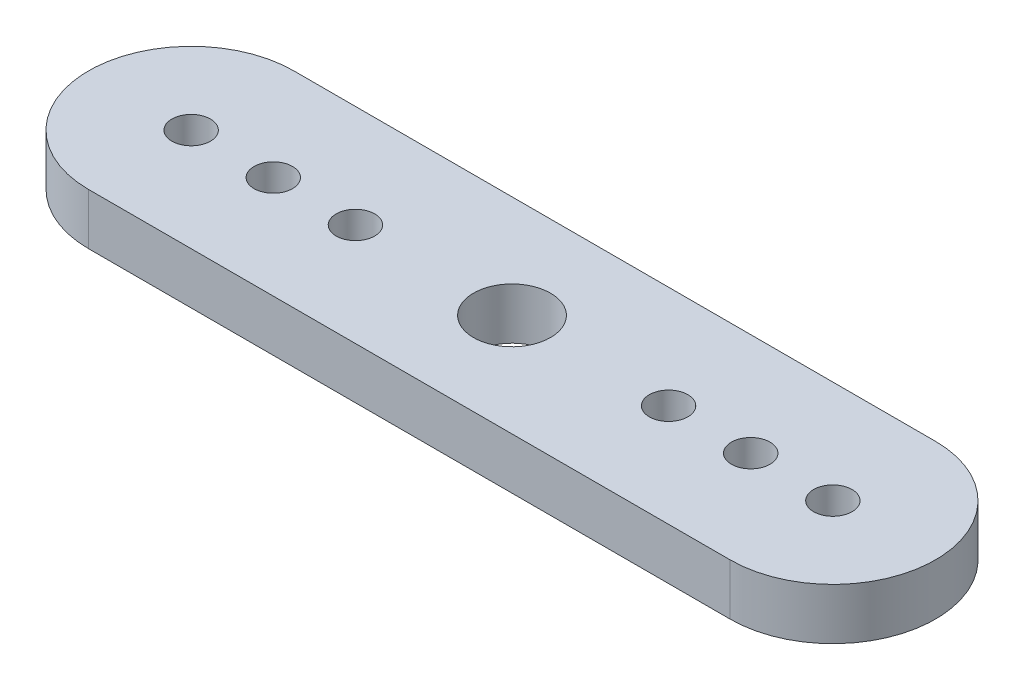
ISO-10303-21;
HEADER;
FILE_DESCRIPTION(('STEP AP214'),'2;1');
FILE_NAME('part.step','',(''),(''),'','','');
FILE_SCHEMA(('AUTOMOTIVE_DESIGN { 1 0 10303 214 1 1 1 1 }'));
ENDSEC;
DATA;
#1=APPLICATION_CONTEXT('core data for automotive mechanical design processes');
#2=APPLICATION_PROTOCOL_DEFINITION('international standard','automotive_design',2000,#1);
#3=PRODUCT_CONTEXT('',#1,'mechanical');
#4=PRODUCT('Part','Part','',(#3));
#5=PRODUCT_RELATED_PRODUCT_CATEGORY('part','',(#4));
#6=PRODUCT_DEFINITION_FORMATION('','',#4);
#7=PRODUCT_DEFINITION_CONTEXT('part definition',#1,'design');
#8=PRODUCT_DEFINITION('design','',#6,#7);
#9=PRODUCT_DEFINITION_SHAPE('','',#8);
#10=(LENGTH_UNIT() NAMED_UNIT(*) SI_UNIT(.MILLI.,.METRE.));
#11=(NAMED_UNIT(*) PLANE_ANGLE_UNIT() SI_UNIT($,.RADIAN.));
#12=(NAMED_UNIT(*) SI_UNIT($,.STERADIAN.) SOLID_ANGLE_UNIT());
#13=UNCERTAINTY_MEASURE_WITH_UNIT(LENGTH_MEASURE(1.E-05),#10,'distance_accuracy_value','');
#14=(GEOMETRIC_REPRESENTATION_CONTEXT(3) GLOBAL_UNCERTAINTY_ASSIGNED_CONTEXT((#13)) GLOBAL_UNIT_ASSIGNED_CONTEXT((#10,
#11,#12)) REPRESENTATION_CONTEXT('',''));
#15=CARTESIAN_POINT('',(0.,0.,0.));
#16=DIRECTION('',(0.,0.,1.));
#17=DIRECTION('',(1.,0.,0.));
#18=AXIS2_PLACEMENT_3D('',#15,#16,#17);
#19=CARTESIAN_POINT('',(0.,-26.,264.));
#20=DIRECTION('',(0.,-1.,0.));
#21=DIRECTION('',(1.,0.,0.));
#22=AXIS2_PLACEMENT_3D('',#19,#20,#21);
#23=PLANE('',#22);
#24=CARTESIAN_POINT('',(-21.8,-26.,264.));
#25=DIRECTION('',(0.,-1.,0.));
#26=DIRECTION('',(-1.,0.,0.));
#27=AXIS2_PLACEMENT_3D('',#24,#25,#26);
#28=CIRCLE('',#27,0.749999999999999);
#29=CARTESIAN_POINT('',(-22.55,-26.,264.));
#30=VERTEX_POINT('',#29);
#31=EDGE_CURVE('E147',#30,#30,#28,.T.);
#32=ORIENTED_EDGE('',*,*,#31,.F.);
#33=EDGE_LOOP('',(#32));
#34=FACE_BOUND('',#33,.T.);
#35=CARTESIAN_POINT('',(-3.2,-26.,264.));
#36=DIRECTION('',(0.,-1.,0.));
#37=DIRECTION('',(1.,0.,0.));
#38=AXIS2_PLACEMENT_3D('',#35,#36,#37);
#39=CIRCLE('',#38,0.750000000000001);
#40=CARTESIAN_POINT('',(-2.45,-26.,264.));
#41=VERTEX_POINT('',#40);
#42=EDGE_CURVE('E135',#41,#41,#39,.T.);
#43=ORIENTED_EDGE('',*,*,#42,.F.);
#44=EDGE_LOOP('',(#43));
#45=FACE_BOUND('',#44,.T.);
#46=CARTESIAN_POINT('',(0.,-26.,264.));
#47=DIRECTION('',(0.,-1.,0.));
#48=DIRECTION('',(1.,0.,0.));
#49=AXIS2_PLACEMENT_3D('',#46,#47,#48);
#50=CIRCLE('',#49,0.750000000000001);
#51=CARTESIAN_POINT('',(0.750000000000004,-26.,264.));
#52=VERTEX_POINT('',#51);
#53=EDGE_CURVE('E123',#52,#52,#50,.T.);
#54=ORIENTED_EDGE('',*,*,#53,.F.);
#55=EDGE_LOOP('',(#54));
#56=FACE_BOUND('',#55,.T.);
#57=CARTESIAN_POINT('',(0.,-26.,264.));
#58=DIRECTION('',(0.,-1.,0.));
#59=DIRECTION('',(1.,0.,0.));
#60=AXIS2_PLACEMENT_3D('',#57,#58,#59);
#61=CIRCLE('',#60,4.);
#62=CARTESIAN_POINT('',(0.,-26.,260.));
#63=VERTEX_POINT('',#62);
#64=CARTESIAN_POINT('',(0.,-26.,268.));
#65=VERTEX_POINT('',#64);
#66=EDGE_CURVE('E93',#63,#65,#61,.T.);
#67=ORIENTED_EDGE('',*,*,#66,.T.);
#68=DIRECTION('',(-1.,0.,0.));
#69=VECTOR('',#68,1.);
#70=CARTESIAN_POINT('',(0.,-26.,268.));
#71=LINE('',#70,#69);
#72=CARTESIAN_POINT('',(-25.,-26.,268.));
#73=VERTEX_POINT('',#72);
#74=EDGE_CURVE('E88',#65,#73,#71,.T.);
#75=ORIENTED_EDGE('',*,*,#74,.T.);
#76=CARTESIAN_POINT('',(-25.,-26.,264.));
#77=DIRECTION('',(0.,-1.,0.));
#78=DIRECTION('',(1.,0.,0.));
#79=AXIS2_PLACEMENT_3D('',#76,#77,#78);
#80=CIRCLE('',#79,4.);
#81=CARTESIAN_POINT('',(-25.,-26.,260.));
#82=VERTEX_POINT('',#81);
#83=EDGE_CURVE('E91',#73,#82,#80,.T.);
#84=ORIENTED_EDGE('',*,*,#83,.T.);
#85=DIRECTION('',(1.,0.,0.));
#86=VECTOR('',#85,1.);
#87=CARTESIAN_POINT('',(0.,-26.,260.));
#88=LINE('',#87,#86);
#89=EDGE_CURVE('E58',#82,#63,#88,.T.);
#90=ORIENTED_EDGE('',*,*,#89,.T.);
#91=EDGE_LOOP('',(#67,#75,#84,#90));
#92=FACE_BOUND('',#91,.T.);
#93=CARTESIAN_POINT('',(-12.5,-26.,264.));
#94=DIRECTION('',(0.,-1.,0.));
#95=DIRECTION('',(1.,0.,0.));
#96=AXIS2_PLACEMENT_3D('',#93,#94,#95);
#97=CIRCLE('',#96,1.5);
#98=CARTESIAN_POINT('',(-11.,-26.,264.));
#99=VERTEX_POINT('',#98);
#100=EDGE_CURVE('E108',#99,#99,#97,.T.);
#101=ORIENTED_EDGE('',*,*,#100,.F.);
#102=EDGE_LOOP('',(#101));
#103=FACE_BOUND('',#102,.T.);
#104=CARTESIAN_POINT('',(-6.4,-26.,264.));
#105=DIRECTION('',(0.,-1.,0.));
#106=DIRECTION('',(1.,0.,0.));
#107=AXIS2_PLACEMENT_3D('',#104,#105,#106);
#108=CIRCLE('',#107,0.750000000000001);
#109=CARTESIAN_POINT('',(-5.65,-26.,264.));
#110=VERTEX_POINT('',#109);
#111=EDGE_CURVE('E129',#110,#110,#108,.T.);
#112=ORIENTED_EDGE('',*,*,#111,.F.);
#113=EDGE_LOOP('',(#112));
#114=FACE_BOUND('',#113,.T.);
#115=CARTESIAN_POINT('',(-25.,-26.,264.));
#116=DIRECTION('',(0.,-1.,0.));
#117=DIRECTION('',(-1.,0.,0.));
#118=AXIS2_PLACEMENT_3D('',#115,#116,#117);
#119=CIRCLE('',#118,0.750000000000002);
#120=CARTESIAN_POINT('',(-25.75,-26.,264.));
#121=VERTEX_POINT('',#120);
#122=EDGE_CURVE('E141',#121,#121,#119,.T.);
#123=ORIENTED_EDGE('',*,*,#122,.F.);
#124=EDGE_LOOP('',(#123));
#125=FACE_BOUND('',#124,.T.);
#126=CARTESIAN_POINT('',(-18.6,-26.,264.));
#127=DIRECTION('',(0.,-1.,0.));
#128=DIRECTION('',(-1.,0.,0.));
#129=AXIS2_PLACEMENT_3D('',#126,#127,#128);
#130=CIRCLE('',#129,0.749999999999999);
#131=CARTESIAN_POINT('',(-19.35,-26.,264.));
#132=VERTEX_POINT('',#131);
#133=EDGE_CURVE('E153',#132,#132,#130,.T.);
#134=ORIENTED_EDGE('',*,*,#133,.F.);
#135=EDGE_LOOP('',(#134));
#136=FACE_BOUND('',#135,.T.);
#137=ADVANCED_FACE('F41',(#34,#45,#56,#92,#103,#114,#125,#136),#23,.T.);
#138=CARTESIAN_POINT('',(0.,-24.,264.));
#139=DIRECTION('',(0.,-1.,0.));
#140=DIRECTION('',(1.,0.,0.));
#141=AXIS2_PLACEMENT_3D('',#138,#139,#140);
#142=PLANE('',#141);
#143=CARTESIAN_POINT('',(0.,-24.,264.));
#144=DIRECTION('',(0.,-1.,0.));
#145=DIRECTION('',(1.,0.,0.));
#146=AXIS2_PLACEMENT_3D('',#143,#144,#145);
#147=CIRCLE('',#146,4.);
#148=CARTESIAN_POINT('',(0.,-24.,260.));
#149=VERTEX_POINT('',#148);
#150=CARTESIAN_POINT('',(0.,-24.,268.));
#151=VERTEX_POINT('',#150);
#152=EDGE_CURVE('E105',#149,#151,#147,.T.);
#153=ORIENTED_EDGE('',*,*,#152,.F.);
#154=DIRECTION('',(1.,0.,0.));
#155=VECTOR('',#154,1.);
#156=CARTESIAN_POINT('',(0.,-24.,260.));
#157=LINE('',#156,#155);
#158=CARTESIAN_POINT('',(-25.,-24.,260.));
#159=VERTEX_POINT('',#158);
#160=EDGE_CURVE('E81',#159,#149,#157,.T.);
#161=ORIENTED_EDGE('',*,*,#160,.F.);
#162=CARTESIAN_POINT('',(-25.,-24.,264.));
#163=DIRECTION('',(0.,-1.,0.));
#164=DIRECTION('',(1.,0.,0.));
#165=AXIS2_PLACEMENT_3D('',#162,#163,#164);
#166=CIRCLE('',#165,4.);
#167=CARTESIAN_POINT('',(-25.,-24.,268.));
#168=VERTEX_POINT('',#167);
#169=EDGE_CURVE('E75',#168,#159,#166,.T.);
#170=ORIENTED_EDGE('',*,*,#169,.F.);
#171=DIRECTION('',(-1.,0.,0.));
#172=VECTOR('',#171,1.);
#173=CARTESIAN_POINT('',(0.,-24.,268.));
#174=LINE('',#173,#172);
#175=EDGE_CURVE('E97',#151,#168,#174,.T.);
#176=ORIENTED_EDGE('',*,*,#175,.F.);
#177=EDGE_LOOP('',(#153,#161,#170,#176));
#178=FACE_BOUND('',#177,.T.);
#179=CARTESIAN_POINT('',(-12.5,-24.,264.));
#180=DIRECTION('',(0.,-1.,0.));
#181=DIRECTION('',(1.,0.,0.));
#182=AXIS2_PLACEMENT_3D('',#179,#180,#181);
#183=CIRCLE('',#182,1.5);
#184=CARTESIAN_POINT('',(-11.,-24.,264.));
#185=VERTEX_POINT('',#184);
#186=EDGE_CURVE('E120',#185,#185,#183,.T.);
#187=ORIENTED_EDGE('',*,*,#186,.T.);
#188=EDGE_LOOP('',(#187));
#189=FACE_BOUND('',#188,.T.);
#190=CARTESIAN_POINT('',(0.,-24.,264.));
#191=DIRECTION('',(0.,-1.,0.));
#192=DIRECTION('',(1.,0.,0.));
#193=AXIS2_PLACEMENT_3D('',#190,#191,#192);
#194=CIRCLE('',#193,0.750000000000001);
#195=CARTESIAN_POINT('',(0.750000000000004,-24.,264.));
#196=VERTEX_POINT('',#195);
#197=EDGE_CURVE('E126',#196,#196,#194,.T.);
#198=ORIENTED_EDGE('',*,*,#197,.T.);
#199=EDGE_LOOP('',(#198));
#200=FACE_BOUND('',#199,.T.);
#201=CARTESIAN_POINT('',(-6.4,-24.,264.));
#202=DIRECTION('',(0.,-1.,0.));
#203=DIRECTION('',(1.,0.,0.));
#204=AXIS2_PLACEMENT_3D('',#201,#202,#203);
#205=CIRCLE('',#204,0.750000000000001);
#206=CARTESIAN_POINT('',(-5.65,-24.,264.));
#207=VERTEX_POINT('',#206);
#208=EDGE_CURVE('E132',#207,#207,#205,.T.);
#209=ORIENTED_EDGE('',*,*,#208,.T.);
#210=EDGE_LOOP('',(#209));
#211=FACE_BOUND('',#210,.T.);
#212=CARTESIAN_POINT('',(-3.2,-24.,264.));
#213=DIRECTION('',(0.,-1.,0.));
#214=DIRECTION('',(1.,0.,0.));
#215=AXIS2_PLACEMENT_3D('',#212,#213,#214);
#216=CIRCLE('',#215,0.750000000000001);
#217=CARTESIAN_POINT('',(-2.45,-24.,264.));
#218=VERTEX_POINT('',#217);
#219=EDGE_CURVE('E138',#218,#218,#216,.T.);
#220=ORIENTED_EDGE('',*,*,#219,.T.);
#221=EDGE_LOOP('',(#220));
#222=FACE_BOUND('',#221,.T.);
#223=CARTESIAN_POINT('',(-25.,-24.,264.));
#224=DIRECTION('',(0.,-1.,0.));
#225=DIRECTION('',(-1.,0.,0.));
#226=AXIS2_PLACEMENT_3D('',#223,#224,#225);
#227=CIRCLE('',#226,0.750000000000002);
#228=CARTESIAN_POINT('',(-25.75,-24.,264.));
#229=VERTEX_POINT('',#228);
#230=EDGE_CURVE('E144',#229,#229,#227,.T.);
#231=ORIENTED_EDGE('',*,*,#230,.T.);
#232=EDGE_LOOP('',(#231));
#233=FACE_BOUND('',#232,.T.);
#234=CARTESIAN_POINT('',(-21.8,-24.,264.));
#235=DIRECTION('',(0.,-1.,0.));
#236=DIRECTION('',(-1.,0.,0.));
#237=AXIS2_PLACEMENT_3D('',#234,#235,#236);
#238=CIRCLE('',#237,0.749999999999999);
#239=CARTESIAN_POINT('',(-22.55,-24.,264.));
#240=VERTEX_POINT('',#239);
#241=EDGE_CURVE('E150',#240,#240,#238,.T.);
#242=ORIENTED_EDGE('',*,*,#241,.T.);
#243=EDGE_LOOP('',(#242));
#244=FACE_BOUND('',#243,.T.);
#245=CARTESIAN_POINT('',(-18.6,-24.,264.));
#246=DIRECTION('',(0.,-1.,0.));
#247=DIRECTION('',(-1.,0.,0.));
#248=AXIS2_PLACEMENT_3D('',#245,#246,#247);
#249=CIRCLE('',#248,0.749999999999999);
#250=CARTESIAN_POINT('',(-19.35,-24.,264.));
#251=VERTEX_POINT('',#250);
#252=EDGE_CURVE('E156',#251,#251,#249,.T.);
#253=ORIENTED_EDGE('',*,*,#252,.T.);
#254=EDGE_LOOP('',(#253));
#255=FACE_BOUND('',#254,.T.);
#256=ADVANCED_FACE('F116',(#178,#189,#200,#211,#222,#233,#244,#255),#142,.F.);
#257=CARTESIAN_POINT('',(0.,-26.,264.));
#258=DIRECTION('',(0.,1.,0.));
#259=DIRECTION('',(-1.,0.,0.));
#260=AXIS2_PLACEMENT_3D('',#257,#258,#259);
#261=CYLINDRICAL_SURFACE('',#260,4.);
#262=ORIENTED_EDGE('',*,*,#152,.T.);
#263=DIRECTION('',(0.,1.,0.));
#264=VECTOR('',#263,1.);
#265=CARTESIAN_POINT('',(0.,-26.,268.));
#266=LINE('',#265,#264);
#267=EDGE_CURVE('E11',#65,#151,#266,.T.);
#268=ORIENTED_EDGE('',*,*,#267,.F.);
#269=ORIENTED_EDGE('',*,*,#66,.F.);
#270=DIRECTION('',(0.,1.,0.));
#271=VECTOR('',#270,1.);
#272=CARTESIAN_POINT('',(0.,-26.,260.));
#273=LINE('',#272,#271);
#274=EDGE_CURVE('E101',#63,#149,#273,.T.);
#275=ORIENTED_EDGE('',*,*,#274,.T.);
#276=EDGE_LOOP('',(#262,#268,#269,#275));
#277=FACE_BOUND('',#276,.T.);
#278=ADVANCED_FACE('F43',(#277),#261,.T.);
#279=CARTESIAN_POINT('',(0.,-26.,268.));
#280=DIRECTION('',(0.,0.,-1.));
#281=DIRECTION('',(-1.,0.,0.));
#282=AXIS2_PLACEMENT_3D('',#279,#280,#281);
#283=PLANE('',#282);
#284=ORIENTED_EDGE('',*,*,#175,.T.);
#285=DIRECTION('',(0.,1.,0.));
#286=VECTOR('',#285,1.);
#287=CARTESIAN_POINT('',(-25.,-26.,268.));
#288=LINE('',#287,#286);
#289=EDGE_CURVE('E50',#73,#168,#288,.T.);
#290=ORIENTED_EDGE('',*,*,#289,.F.);
#291=ORIENTED_EDGE('',*,*,#74,.F.);
#292=ORIENTED_EDGE('',*,*,#267,.T.);
#293=EDGE_LOOP('',(#284,#290,#291,#292));
#294=FACE_BOUND('',#293,.T.);
#295=ADVANCED_FACE('F96',(#294),#283,.F.);
#296=CARTESIAN_POINT('',(-25.,-26.,264.));
#297=DIRECTION('',(0.,1.,0.));
#298=DIRECTION('',(-1.,0.,0.));
#299=AXIS2_PLACEMENT_3D('',#296,#297,#298);
#300=CYLINDRICAL_SURFACE('',#299,4.);
#301=ORIENTED_EDGE('',*,*,#169,.T.);
#302=DIRECTION('',(0.,1.,0.));
#303=VECTOR('',#302,1.);
#304=CARTESIAN_POINT('',(-25.,-26.,260.));
#305=LINE('',#304,#303);
#306=EDGE_CURVE('E98',#82,#159,#305,.T.);
#307=ORIENTED_EDGE('',*,*,#306,.F.);
#308=ORIENTED_EDGE('',*,*,#83,.F.);
#309=ORIENTED_EDGE('',*,*,#289,.T.);
#310=EDGE_LOOP('',(#301,#307,#308,#309));
#311=FACE_BOUND('',#310,.T.);
#312=ADVANCED_FACE('F99',(#311),#300,.T.);
#313=CARTESIAN_POINT('',(0.,-26.,260.));
#314=DIRECTION('',(0.,0.,1.));
#315=DIRECTION('',(1.,0.,0.));
#316=AXIS2_PLACEMENT_3D('',#313,#314,#315);
#317=PLANE('',#316);
#318=ORIENTED_EDGE('',*,*,#160,.T.);
#319=ORIENTED_EDGE('',*,*,#274,.F.);
#320=ORIENTED_EDGE('',*,*,#89,.F.);
#321=ORIENTED_EDGE('',*,*,#306,.T.);
#322=EDGE_LOOP('',(#318,#319,#320,#321));
#323=FACE_BOUND('',#322,.T.);
#324=ADVANCED_FACE('F113',(#323),#317,.F.);
#325=CARTESIAN_POINT('',(-12.5,-26.,264.));
#326=DIRECTION('',(0.,1.,0.));
#327=DIRECTION('',(-1.,0.,0.));
#328=AXIS2_PLACEMENT_3D('',#325,#326,#327);
#329=CYLINDRICAL_SURFACE('',#328,1.5);
#330=ORIENTED_EDGE('',*,*,#100,.T.);
#331=EDGE_LOOP('',(#330));
#332=FACE_BOUND('',#331,.T.);
#333=ORIENTED_EDGE('',*,*,#186,.F.);
#334=EDGE_LOOP('',(#333));
#335=FACE_BOUND('',#334,.T.);
#336=ADVANCED_FACE('F176',(#332,#335),#329,.F.);
#337=CARTESIAN_POINT('',(0.,-26.,264.));
#338=DIRECTION('',(0.,1.,0.));
#339=DIRECTION('',(-1.,0.,0.));
#340=AXIS2_PLACEMENT_3D('',#337,#338,#339);
#341=CYLINDRICAL_SURFACE('',#340,0.750000000000001);
#342=ORIENTED_EDGE('',*,*,#53,.T.);
#343=EDGE_LOOP('',(#342));
#344=FACE_BOUND('',#343,.T.);
#345=ORIENTED_EDGE('',*,*,#197,.F.);
#346=EDGE_LOOP('',(#345));
#347=FACE_BOUND('',#346,.T.);
#348=ADVANCED_FACE('F218',(#344,#347),#341,.F.);
#349=CARTESIAN_POINT('',(-6.4,-26.,264.));
#350=DIRECTION('',(0.,1.,0.));
#351=DIRECTION('',(-1.,0.,0.));
#352=AXIS2_PLACEMENT_3D('',#349,#350,#351);
#353=CYLINDRICAL_SURFACE('',#352,0.750000000000001);
#354=ORIENTED_EDGE('',*,*,#111,.T.);
#355=EDGE_LOOP('',(#354));
#356=FACE_BOUND('',#355,.T.);
#357=ORIENTED_EDGE('',*,*,#208,.F.);
#358=EDGE_LOOP('',(#357));
#359=FACE_BOUND('',#358,.T.);
#360=ADVANCED_FACE('F225',(#356,#359),#353,.F.);
#361=CARTESIAN_POINT('',(-3.2,-26.,264.));
#362=DIRECTION('',(0.,1.,0.));
#363=DIRECTION('',(-1.,0.,0.));
#364=AXIS2_PLACEMENT_3D('',#361,#362,#363);
#365=CYLINDRICAL_SURFACE('',#364,0.750000000000001);
#366=ORIENTED_EDGE('',*,*,#42,.T.);
#367=EDGE_LOOP('',(#366));
#368=FACE_BOUND('',#367,.T.);
#369=ORIENTED_EDGE('',*,*,#219,.F.);
#370=EDGE_LOOP('',(#369));
#371=FACE_BOUND('',#370,.T.);
#372=ADVANCED_FACE('F232',(#368,#371),#365,.F.);
#373=CARTESIAN_POINT('',(-25.,-26.,264.));
#374=DIRECTION('',(0.,1.,0.));
#375=DIRECTION('',(-1.,0.,0.));
#376=AXIS2_PLACEMENT_3D('',#373,#374,#375);
#377=CYLINDRICAL_SURFACE('',#376,0.750000000000002);
#378=ORIENTED_EDGE('',*,*,#122,.T.);
#379=EDGE_LOOP('',(#378));
#380=FACE_BOUND('',#379,.T.);
#381=ORIENTED_EDGE('',*,*,#230,.F.);
#382=EDGE_LOOP('',(#381));
#383=FACE_BOUND('',#382,.T.);
#384=ADVANCED_FACE('F240',(#380,#383),#377,.F.);
#385=CARTESIAN_POINT('',(-21.8,-26.,264.));
#386=DIRECTION('',(0.,1.,0.));
#387=DIRECTION('',(-1.,0.,0.));
#388=AXIS2_PLACEMENT_3D('',#385,#386,#387);
#389=CYLINDRICAL_SURFACE('',#388,0.749999999999999);
#390=ORIENTED_EDGE('',*,*,#31,.T.);
#391=EDGE_LOOP('',(#390));
#392=FACE_BOUND('',#391,.T.);
#393=ORIENTED_EDGE('',*,*,#241,.F.);
#394=EDGE_LOOP('',(#393));
#395=FACE_BOUND('',#394,.T.);
#396=ADVANCED_FACE('F248',(#392,#395),#389,.F.);
#397=CARTESIAN_POINT('',(-18.6,-26.,264.));
#398=DIRECTION('',(0.,1.,0.));
#399=DIRECTION('',(-1.,0.,0.));
#400=AXIS2_PLACEMENT_3D('',#397,#398,#399);
#401=CYLINDRICAL_SURFACE('',#400,0.749999999999999);
#402=ORIENTED_EDGE('',*,*,#133,.T.);
#403=EDGE_LOOP('',(#402));
#404=FACE_BOUND('',#403,.T.);
#405=ORIENTED_EDGE('',*,*,#252,.F.);
#406=EDGE_LOOP('',(#405));
#407=FACE_BOUND('',#406,.T.);
#408=ADVANCED_FACE('F162',(#404,#407),#401,.F.);
#409=CLOSED_SHELL('',(#137,#256,#278,#295,#312,#324,#336,#348,#360,#372,#384,#396,#408));
#410=MANIFOLD_SOLID_BREP('B2',#409);
#411=ADVANCED_BREP_SHAPE_REPRESENTATION('',(#18,#410),#14);
#412=SHAPE_DEFINITION_REPRESENTATION(#9,#411);
ENDSEC;
END-ISO-10303-21;
